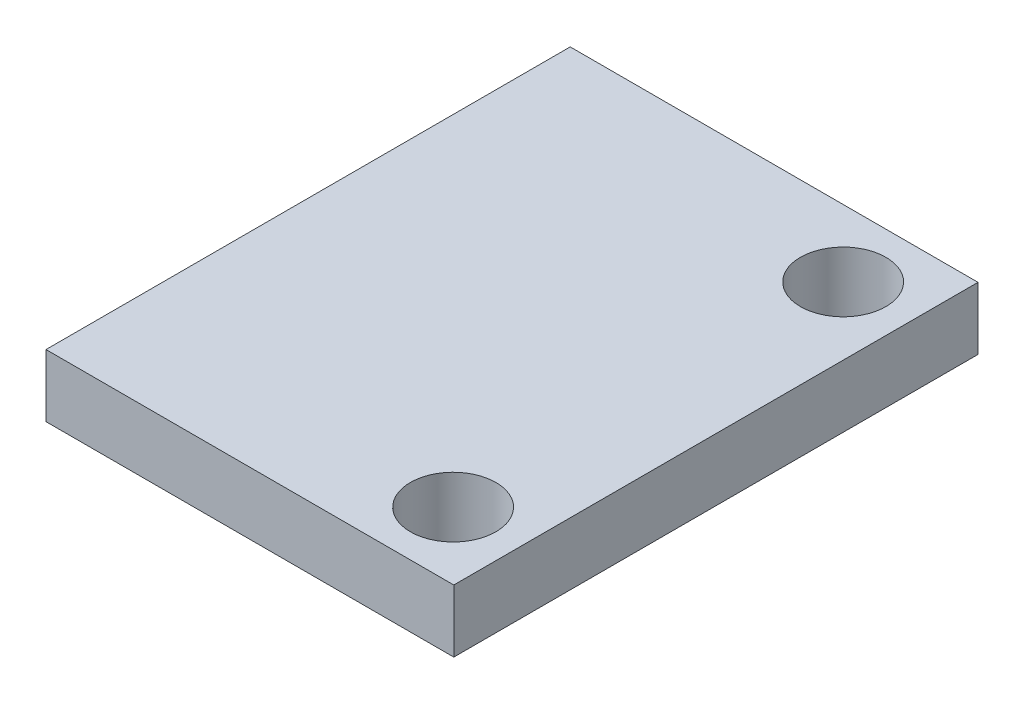
ISO-10303-21;
HEADER;
FILE_DESCRIPTION(('STEP AP214'),'2;1');
FILE_NAME('part.step','',(''),(''),'','','');
FILE_SCHEMA(('AUTOMOTIVE_DESIGN { 1 0 10303 214 1 1 1 1 }'));
ENDSEC;
DATA;
#1=APPLICATION_CONTEXT('core data for automotive mechanical design processes');
#2=APPLICATION_PROTOCOL_DEFINITION('international standard','automotive_design',2000,#1);
#3=PRODUCT_CONTEXT('',#1,'mechanical');
#4=PRODUCT('Part','Part','',(#3));
#5=PRODUCT_RELATED_PRODUCT_CATEGORY('part','',(#4));
#6=PRODUCT_DEFINITION_FORMATION('','',#4);
#7=PRODUCT_DEFINITION_CONTEXT('part definition',#1,'design');
#8=PRODUCT_DEFINITION('design','',#6,#7);
#9=PRODUCT_DEFINITION_SHAPE('','',#8);
#10=(LENGTH_UNIT() NAMED_UNIT(*) SI_UNIT(.MILLI.,.METRE.));
#11=(NAMED_UNIT(*) PLANE_ANGLE_UNIT() SI_UNIT($,.RADIAN.));
#12=(NAMED_UNIT(*) SI_UNIT($,.STERADIAN.) SOLID_ANGLE_UNIT());
#13=UNCERTAINTY_MEASURE_WITH_UNIT(LENGTH_MEASURE(1.E-05),#10,'distance_accuracy_value','');
#14=(GEOMETRIC_REPRESENTATION_CONTEXT(3) GLOBAL_UNCERTAINTY_ASSIGNED_CONTEXT((#13)) GLOBAL_UNIT_ASSIGNED_CONTEXT((#10,
#11,#12)) REPRESENTATION_CONTEXT('',''));
#15=CARTESIAN_POINT('',(0.,0.,0.));
#16=DIRECTION('',(0.,0.,1.));
#17=DIRECTION('',(1.,0.,0.));
#18=AXIS2_PLACEMENT_3D('',#15,#16,#17);
#19=CARTESIAN_POINT('',(0.,2.413,0.));
#20=DIRECTION('',(0.,-1.,0.));
#21=DIRECTION('',(0.,0.,-1.));
#22=AXIS2_PLACEMENT_3D('',#19,#20,#21);
#23=PLANE('',#22);
#24=DIRECTION('',(0.,0.,-1.));
#25=VECTOR('',#24,1.);
#26=CARTESIAN_POINT('',(7.874,2.413,10.1219));
#27=LINE('',#26,#25);
#28=CARTESIAN_POINT('',(7.874,2.413,10.1219));
#29=VERTEX_POINT('',#28);
#30=CARTESIAN_POINT('',(7.874,2.413,-10.1219));
#31=VERTEX_POINT('',#30);
#32=EDGE_CURVE('E97',#29,#31,#27,.T.);
#33=ORIENTED_EDGE('',*,*,#32,.T.);
#34=DIRECTION('',(-1.,0.,0.));
#35=VECTOR('',#34,1.);
#36=CARTESIAN_POINT('',(-7.874,2.413,-10.1219));
#37=LINE('',#36,#35);
#38=CARTESIAN_POINT('',(-7.874,2.413,-10.1219));
#39=VERTEX_POINT('',#38);
#40=EDGE_CURVE('E92',#31,#39,#37,.T.);
#41=ORIENTED_EDGE('',*,*,#40,.T.);
#42=DIRECTION('',(0.,0.,1.));
#43=VECTOR('',#42,1.);
#44=CARTESIAN_POINT('',(-7.874,2.413,10.1219));
#45=LINE('',#44,#43);
#46=CARTESIAN_POINT('',(-7.874,2.413,10.1219));
#47=VERTEX_POINT('',#46);
#48=EDGE_CURVE('E95',#39,#47,#45,.T.);
#49=ORIENTED_EDGE('',*,*,#48,.T.);
#50=DIRECTION('',(1.,0.,0.));
#51=VECTOR('',#50,1.);
#52=CARTESIAN_POINT('',(-7.874,2.413,10.1219));
#53=LINE('',#52,#51);
#54=EDGE_CURVE('E62',#47,#29,#53,.T.);
#55=ORIENTED_EDGE('',*,*,#54,.T.);
#56=EDGE_LOOP('',(#33,#41,#49,#55));
#57=FACE_BOUND('',#56,.T.);
#58=CARTESIAN_POINT('',(5.2578,2.413,-7.5311));
#59=DIRECTION('',(0.,1.,0.));
#60=DIRECTION('',(0.,0.,1.));
#61=AXIS2_PLACEMENT_3D('',#58,#59,#60);
#62=CIRCLE('',#61,1.651);
#63=CARTESIAN_POINT('',(5.2578,2.413,-5.8801));
#64=VERTEX_POINT('',#63);
#65=EDGE_CURVE('E112',#64,#64,#62,.T.);
#66=ORIENTED_EDGE('',*,*,#65,.F.);
#67=EDGE_LOOP('',(#66));
#68=FACE_BOUND('',#67,.T.);
#69=CARTESIAN_POINT('',(5.2578,2.413,7.5311));
#70=DIRECTION('',(0.,1.,0.));
#71=DIRECTION('',(0.,0.,1.));
#72=AXIS2_PLACEMENT_3D('',#69,#70,#71);
#73=CIRCLE('',#72,1.651);
#74=CARTESIAN_POINT('',(5.2578,2.413,9.1821));
#75=VERTEX_POINT('',#74);
#76=EDGE_CURVE('E127',#75,#75,#73,.T.);
#77=ORIENTED_EDGE('',*,*,#76,.F.);
#78=EDGE_LOOP('',(#77));
#79=FACE_BOUND('',#78,.T.);
#80=ADVANCED_FACE('F45',(#57,#68,#79),#23,.F.);
#81=CARTESIAN_POINT('',(0.,0.,0.));
#82=DIRECTION('',(0.,-1.,0.));
#83=DIRECTION('',(0.,0.,-1.));
#84=AXIS2_PLACEMENT_3D('',#81,#82,#83);
#85=PLANE('',#84);
#86=CARTESIAN_POINT('',(5.2578,0.,-7.5311));
#87=DIRECTION('',(0.,1.,0.));
#88=DIRECTION('',(0.,0.,1.));
#89=AXIS2_PLACEMENT_3D('',#86,#87,#88);
#90=CIRCLE('',#89,1.651);
#91=CARTESIAN_POINT('',(5.2578,0.,-5.8801));
#92=VERTEX_POINT('',#91);
#93=EDGE_CURVE('E124',#92,#92,#90,.T.);
#94=ORIENTED_EDGE('',*,*,#93,.T.);
#95=EDGE_LOOP('',(#94));
#96=FACE_BOUND('',#95,.T.);
#97=DIRECTION('',(0.,0.,-1.));
#98=VECTOR('',#97,1.);
#99=CARTESIAN_POINT('',(7.874,0.,10.1219));
#100=LINE('',#99,#98);
#101=CARTESIAN_POINT('',(7.874,0.,10.1219));
#102=VERTEX_POINT('',#101);
#103=CARTESIAN_POINT('',(7.874,0.,-10.1219));
#104=VERTEX_POINT('',#103);
#105=EDGE_CURVE('E109',#102,#104,#100,.T.);
#106=ORIENTED_EDGE('',*,*,#105,.F.);
#107=DIRECTION('',(1.,0.,0.));
#108=VECTOR('',#107,1.);
#109=CARTESIAN_POINT('',(-7.874,0.,10.1219));
#110=LINE('',#109,#108);
#111=CARTESIAN_POINT('',(-7.874,0.,10.1219));
#112=VERTEX_POINT('',#111);
#113=EDGE_CURVE('E85',#112,#102,#110,.T.);
#114=ORIENTED_EDGE('',*,*,#113,.F.);
#115=DIRECTION('',(0.,0.,1.));
#116=VECTOR('',#115,1.);
#117=CARTESIAN_POINT('',(-7.874,0.,10.1219));
#118=LINE('',#117,#116);
#119=CARTESIAN_POINT('',(-7.874,0.,-10.1219));
#120=VERTEX_POINT('',#119);
#121=EDGE_CURVE('E79',#120,#112,#118,.T.);
#122=ORIENTED_EDGE('',*,*,#121,.F.);
#123=DIRECTION('',(-1.,0.,0.));
#124=VECTOR('',#123,1.);
#125=CARTESIAN_POINT('',(-7.874,0.,-10.1219));
#126=LINE('',#125,#124);
#127=EDGE_CURVE('E101',#104,#120,#126,.T.);
#128=ORIENTED_EDGE('',*,*,#127,.F.);
#129=EDGE_LOOP('',(#106,#114,#122,#128));
#130=FACE_BOUND('',#129,.T.);
#131=CARTESIAN_POINT('',(5.2578,0.,7.5311));
#132=DIRECTION('',(0.,1.,0.));
#133=DIRECTION('',(0.,0.,1.));
#134=AXIS2_PLACEMENT_3D('',#131,#132,#133);
#135=CIRCLE('',#134,1.651);
#136=CARTESIAN_POINT('',(5.2578,0.,9.1821));
#137=VERTEX_POINT('',#136);
#138=EDGE_CURVE('E130',#137,#137,#135,.T.);
#139=ORIENTED_EDGE('',*,*,#138,.T.);
#140=EDGE_LOOP('',(#139));
#141=FACE_BOUND('',#140,.T.);
#142=ADVANCED_FACE('F120',(#96,#130,#141),#85,.T.);
#143=CARTESIAN_POINT('',(7.874,2.413,10.1219));
#144=DIRECTION('',(-1.,0.,0.));
#145=DIRECTION('',(0.,0.,1.));
#146=AXIS2_PLACEMENT_3D('',#143,#144,#145);
#147=PLANE('',#146);
#148=ORIENTED_EDGE('',*,*,#105,.T.);
#149=DIRECTION('',(0.,-1.,0.));
#150=VECTOR('',#149,1.);
#151=CARTESIAN_POINT('',(7.874,2.413,-10.1219));
#152=LINE('',#151,#150);
#153=EDGE_CURVE('E11',#31,#104,#152,.T.);
#154=ORIENTED_EDGE('',*,*,#153,.F.);
#155=ORIENTED_EDGE('',*,*,#32,.F.);
#156=DIRECTION('',(0.,-1.,0.));
#157=VECTOR('',#156,1.);
#158=CARTESIAN_POINT('',(7.874,2.413,10.1219));
#159=LINE('',#158,#157);
#160=EDGE_CURVE('E105',#29,#102,#159,.T.);
#161=ORIENTED_EDGE('',*,*,#160,.T.);
#162=EDGE_LOOP('',(#148,#154,#155,#161));
#163=FACE_BOUND('',#162,.T.);
#164=ADVANCED_FACE('F47',(#163),#147,.F.);
#165=CARTESIAN_POINT('',(-7.874,2.413,-10.1219));
#166=DIRECTION('',(0.,0.,1.));
#167=DIRECTION('',(1.,0.,0.));
#168=AXIS2_PLACEMENT_3D('',#165,#166,#167);
#169=PLANE('',#168);
#170=ORIENTED_EDGE('',*,*,#127,.T.);
#171=DIRECTION('',(0.,-1.,0.));
#172=VECTOR('',#171,1.);
#173=CARTESIAN_POINT('',(-7.874,2.413,-10.1219));
#174=LINE('',#173,#172);
#175=EDGE_CURVE('E54',#39,#120,#174,.T.);
#176=ORIENTED_EDGE('',*,*,#175,.F.);
#177=ORIENTED_EDGE('',*,*,#40,.F.);
#178=ORIENTED_EDGE('',*,*,#153,.T.);
#179=EDGE_LOOP('',(#170,#176,#177,#178));
#180=FACE_BOUND('',#179,.T.);
#181=ADVANCED_FACE('F100',(#180),#169,.F.);
#182=CARTESIAN_POINT('',(-7.874,2.413,10.1219));
#183=DIRECTION('',(1.,0.,0.));
#184=DIRECTION('',(0.,0.,-1.));
#185=AXIS2_PLACEMENT_3D('',#182,#183,#184);
#186=PLANE('',#185);
#187=ORIENTED_EDGE('',*,*,#121,.T.);
#188=DIRECTION('',(0.,-1.,0.));
#189=VECTOR('',#188,1.);
#190=CARTESIAN_POINT('',(-7.874,2.413,10.1219));
#191=LINE('',#190,#189);
#192=EDGE_CURVE('E102',#47,#112,#191,.T.);
#193=ORIENTED_EDGE('',*,*,#192,.F.);
#194=ORIENTED_EDGE('',*,*,#48,.F.);
#195=ORIENTED_EDGE('',*,*,#175,.T.);
#196=EDGE_LOOP('',(#187,#193,#194,#195));
#197=FACE_BOUND('',#196,.T.);
#198=ADVANCED_FACE('F103',(#197),#186,.F.);
#199=CARTESIAN_POINT('',(-7.874,2.413,10.1219));
#200=DIRECTION('',(0.,0.,-1.));
#201=DIRECTION('',(-1.,0.,0.));
#202=AXIS2_PLACEMENT_3D('',#199,#200,#201);
#203=PLANE('',#202);
#204=ORIENTED_EDGE('',*,*,#113,.T.);
#205=ORIENTED_EDGE('',*,*,#160,.F.);
#206=ORIENTED_EDGE('',*,*,#54,.F.);
#207=ORIENTED_EDGE('',*,*,#192,.T.);
#208=EDGE_LOOP('',(#204,#205,#206,#207));
#209=FACE_BOUND('',#208,.T.);
#210=ADVANCED_FACE('F117',(#209),#203,.F.);
#211=CARTESIAN_POINT('',(5.2578,2.413,-7.5311));
#212=DIRECTION('',(0.,-1.,0.));
#213=DIRECTION('',(0.,0.,-1.));
#214=AXIS2_PLACEMENT_3D('',#211,#212,#213);
#215=CYLINDRICAL_SURFACE('',#214,1.651);
#216=ORIENTED_EDGE('',*,*,#65,.T.);
#217=EDGE_LOOP('',(#216));
#218=FACE_BOUND('',#217,.T.);
#219=ORIENTED_EDGE('',*,*,#93,.F.);
#220=EDGE_LOOP('',(#219));
#221=FACE_BOUND('',#220,.T.);
#222=ADVANCED_FACE('F147',(#218,#221),#215,.F.);
#223=CARTESIAN_POINT('',(5.2578,2.413,7.5311));
#224=DIRECTION('',(0.,-1.,0.));
#225=DIRECTION('',(0.,0.,-1.));
#226=AXIS2_PLACEMENT_3D('',#223,#224,#225);
#227=CYLINDRICAL_SURFACE('',#226,1.651);
#228=ORIENTED_EDGE('',*,*,#76,.T.);
#229=EDGE_LOOP('',(#228));
#230=FACE_BOUND('',#229,.T.);
#231=ORIENTED_EDGE('',*,*,#138,.F.);
#232=EDGE_LOOP('',(#231));
#233=FACE_BOUND('',#232,.T.);
#234=ADVANCED_FACE('F136',(#230,#233),#227,.F.);
#235=CLOSED_SHELL('',(#80,#142,#164,#181,#198,#210,#222,#234));
#236=MANIFOLD_SOLID_BREP('B2',#235);
#237=ADVANCED_BREP_SHAPE_REPRESENTATION('',(#18,#236),#14);
#238=SHAPE_DEFINITION_REPRESENTATION(#9,#237);
ENDSEC;
END-ISO-10303-21;
